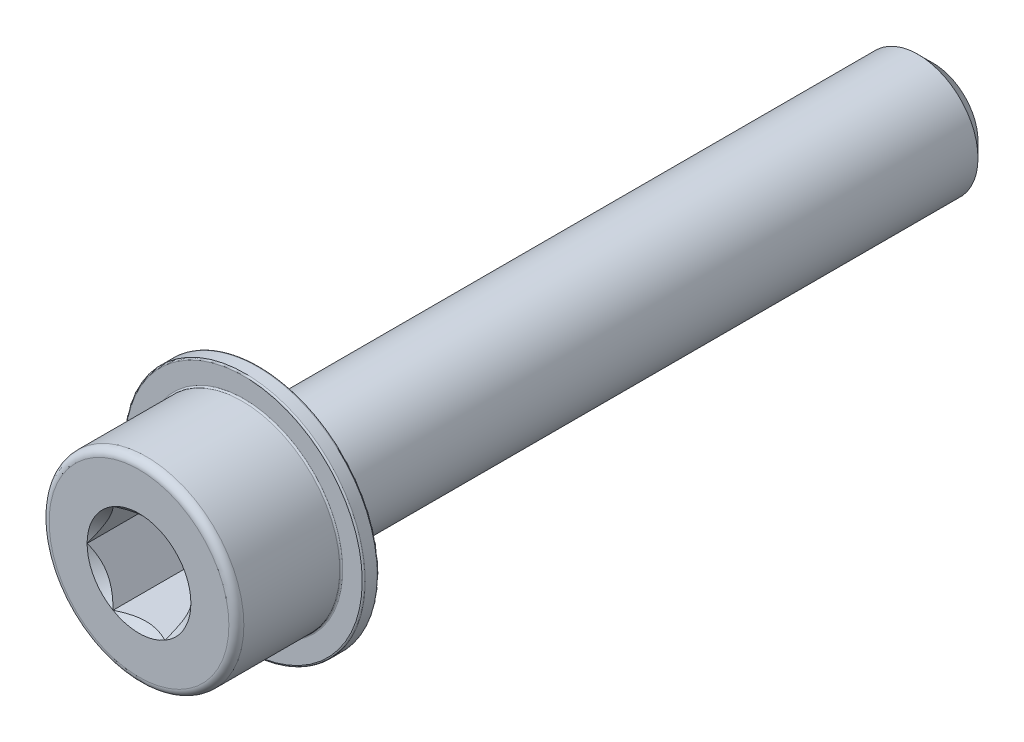
ISO-10303-21;
HEADER;
FILE_DESCRIPTION(('STEP AP214'),'2;1');
FILE_NAME('part.step','',(''),(''),'','','');
FILE_SCHEMA(('AUTOMOTIVE_DESIGN { 1 0 10303 214 1 1 1 1 }'));
ENDSEC;
DATA;
#1=APPLICATION_CONTEXT('core data for automotive mechanical design processes');
#2=APPLICATION_PROTOCOL_DEFINITION('international standard','automotive_design',2000,#1);
#3=PRODUCT_CONTEXT('',#1,'mechanical');
#4=PRODUCT('Part','Part','',(#3));
#5=PRODUCT_RELATED_PRODUCT_CATEGORY('part','',(#4));
#6=PRODUCT_DEFINITION_FORMATION('','',#4);
#7=PRODUCT_DEFINITION_CONTEXT('part definition',#1,'design');
#8=PRODUCT_DEFINITION('design','',#6,#7);
#9=PRODUCT_DEFINITION_SHAPE('','',#8);
#10=(LENGTH_UNIT() NAMED_UNIT(*) SI_UNIT(.MILLI.,.METRE.));
#11=(NAMED_UNIT(*) PLANE_ANGLE_UNIT() SI_UNIT($,.RADIAN.));
#12=(NAMED_UNIT(*) SI_UNIT($,.STERADIAN.) SOLID_ANGLE_UNIT());
#13=UNCERTAINTY_MEASURE_WITH_UNIT(LENGTH_MEASURE(1.E-05),#10,'distance_accuracy_value','');
#14=(GEOMETRIC_REPRESENTATION_CONTEXT(3) GLOBAL_UNCERTAINTY_ASSIGNED_CONTEXT((#13)) GLOBAL_UNIT_ASSIGNED_CONTEXT((#10,
#11,#12)) REPRESENTATION_CONTEXT('',''));
#15=CARTESIAN_POINT('',(0.,0.,0.));
#16=DIRECTION('',(0.,0.,1.));
#17=DIRECTION('',(1.,0.,0.));
#18=AXIS2_PLACEMENT_3D('',#15,#16,#17);
#19=CARTESIAN_POINT('',(0.,0.,53.));
#20=DIRECTION('',(0.,0.,-1.));
#21=DIRECTION('',(-1.,0.,0.));
#22=AXIS2_PLACEMENT_3D('',#19,#20,#21);
#23=CYLINDRICAL_SURFACE('',#22,6.5);
#24=CARTESIAN_POINT('',(0.,0.,46.1));
#25=DIRECTION('',(0.,0.,-1.));
#26=DIRECTION('',(-1.,0.,0.));
#27=AXIS2_PLACEMENT_3D('',#24,#25,#26);
#28=CIRCLE('',#27,6.5);
#29=CARTESIAN_POINT('',(-6.5,0.,46.1));
#30=VERTEX_POINT('',#29);
#31=EDGE_CURVE('E11',#30,#30,#28,.F.);
#32=ORIENTED_EDGE('',*,*,#31,.T.);
#33=EDGE_LOOP('',(#32));
#34=FACE_BOUND('',#33,.T.);
#35=CARTESIAN_POINT('',(0.,0.,52.5));
#36=DIRECTION('',(0.,0.,1.));
#37=DIRECTION('',(1.,0.,0.));
#38=AXIS2_PLACEMENT_3D('',#35,#36,#37);
#39=CIRCLE('',#38,6.5);
#40=CARTESIAN_POINT('',(6.5,0.,52.5));
#41=VERTEX_POINT('',#40);
#42=EDGE_CURVE('E275',#41,#41,#39,.F.);
#43=ORIENTED_EDGE('',*,*,#42,.T.);
#44=EDGE_LOOP('',(#43));
#45=FACE_BOUND('',#44,.T.);
#46=ADVANCED_FACE('F41',(#34,#45),#23,.T.);
#47=CARTESIAN_POINT('',(0.,0.,53.));
#48=DIRECTION('',(0.,0.,1.));
#49=DIRECTION('',(1.,0.,0.));
#50=AXIS2_PLACEMENT_3D('',#47,#48,#49);
#51=PLANE('',#50);
#52=CARTESIAN_POINT('',(0.,0.,53.));
#53=DIRECTION('',(0.,0.,1.));
#54=DIRECTION('',(1.,0.,0.));
#55=AXIS2_PLACEMENT_3D('',#52,#53,#54);
#56=CIRCLE('',#55,6.);
#57=CARTESIAN_POINT('',(6.,0.,53.));
#58=VERTEX_POINT('',#57);
#59=EDGE_CURVE('E117',#58,#58,#56,.T.);
#60=ORIENTED_EDGE('',*,*,#59,.T.);
#61=EDGE_LOOP('',(#60));
#62=FACE_BOUND('',#61,.T.);
#63=CARTESIAN_POINT('',(0.,0.,53.));
#64=DIRECTION('',(0.,0.,1.));
#65=DIRECTION('',(1.,0.,0.));
#66=AXIS2_PLACEMENT_3D('',#63,#64,#65);
#67=CIRCLE('',#66,3.46410161513776);
#68=CARTESIAN_POINT('',(3.46410161513776,0.,53.));
#69=VERTEX_POINT('',#68);
#70=CARTESIAN_POINT('',(1.73205080756888,3.,53.));
#71=VERTEX_POINT('',#70);
#72=EDGE_CURVE('E96',#69,#71,#67,.T.);
#73=ORIENTED_EDGE('',*,*,#72,.F.);
#74=CARTESIAN_POINT('',(1.73205080756888,-3.,53.));
#75=VERTEX_POINT('',#74);
#76=EDGE_CURVE('E56',#75,#69,#67,.T.);
#77=ORIENTED_EDGE('',*,*,#76,.F.);
#78=CARTESIAN_POINT('',(-1.73205080756888,-3.,53.));
#79=VERTEX_POINT('',#78);
#80=EDGE_CURVE('E360',#79,#75,#67,.T.);
#81=ORIENTED_EDGE('',*,*,#80,.F.);
#82=CARTESIAN_POINT('',(-3.46410161513776,0.,53.));
#83=VERTEX_POINT('',#82);
#84=EDGE_CURVE('E63',#83,#79,#67,.T.);
#85=ORIENTED_EDGE('',*,*,#84,.F.);
#86=CARTESIAN_POINT('',(-1.73205080756888,3.,53.));
#87=VERTEX_POINT('',#86);
#88=EDGE_CURVE('E141',#87,#83,#67,.T.);
#89=ORIENTED_EDGE('',*,*,#88,.F.);
#90=EDGE_CURVE('E106',#71,#87,#67,.T.);
#91=ORIENTED_EDGE('',*,*,#90,.F.);
#92=EDGE_LOOP('',(#73,#77,#81,#85,#89,#91));
#93=FACE_BOUND('',#92,.T.);
#94=ADVANCED_FACE('F140',(#62,#93),#51,.T.);
#95=CARTESIAN_POINT('',(0.,0.,53.));
#96=DIRECTION('',(0.,0.,1.));
#97=DIRECTION('',(1.,0.,0.));
#98=AXIS2_PLACEMENT_3D('',#95,#96,#97);
#99=CONICAL_SURFACE('',#98,3.46410161513776,0.785398163397449);
#100=ORIENTED_EDGE('',*,*,#90,.T.);
#101=CARTESIAN_POINT('',(-3.40188153141397,3.,54.071623018675));
#102=CARTESIAN_POINT('',(-3.31880839496224,3.,54.0093307707653));
#103=CARTESIAN_POINT('',(-3.23526432463499,3.,53.9476562262713));
#104=CARTESIAN_POINT('',(-3.06705083944725,3.,53.825817186681));
#105=CARTESIAN_POINT('',(-2.98238114192822,3.,53.7656530822642));
#106=CARTESIAN_POINT('',(-2.81111390830011,3.,53.6466823260063));
#107=CARTESIAN_POINT('',(-2.72450651479473,3.,53.5878898159252));
#108=CARTESIAN_POINT('',(-2.54981284655259,3.,53.4725516902232));
#109=CARTESIAN_POINT('',(-2.46172667795769,3.,53.4160059143113));
#110=CARTESIAN_POINT('',(-2.27892768432208,3.,53.3026064434241));
#111=CARTESIAN_POINT('',(-2.18411772294209,3.,53.2459085325007));
#112=CARTESIAN_POINT('',(-1.99231796342786,3.,53.1363338489189));
#113=CARTESIAN_POINT('',(-1.89532845598628,3.,53.0834565706102));
#114=CARTESIAN_POINT('',(-1.69915024178689,3.,52.9826433846406));
#115=CARTESIAN_POINT('',(-1.59996871640864,3.,52.9346936118117));
#116=CARTESIAN_POINT('',(-1.39893527870467,3.,52.8448170133997));
#117=CARTESIAN_POINT('',(-1.29708458210817,3.,52.8028875002659));
#118=CARTESIAN_POINT('',(-1.0982186531427,3.,52.7293601977538));
#119=CARTESIAN_POINT('',(-1.00140329048654,3.,52.6972274830937));
#120=CARTESIAN_POINT('',(-0.805487586800682,3.,52.6407367466802));
#121=CARTESIAN_POINT('',(-0.706387084473372,3.,52.6163792755582));
#122=CARTESIAN_POINT('',(-0.508116211624924,3.,52.5771014895869));
#123=CARTESIAN_POINT('',(-0.408977763183683,3.,52.5620226377466));
#124=CARTESIAN_POINT('',(-0.209698791301063,3.,52.5415865192691));
#125=CARTESIAN_POINT('',(-0.109558431989065,3.,52.5362276857281));
#126=CARTESIAN_POINT('',(0.0873520516843396,3.,52.535609235846));
#127=CARTESIAN_POINT('',(0.184121252918255,3.,52.5400131533177));
#128=CARTESIAN_POINT('',(0.376804854524576,3.,52.557946416793));
#129=CARTESIAN_POINT('',(0.472719169351943,3.,52.5714766658714));
#130=CARTESIAN_POINT('',(0.664619663322419,3.,52.6071635369876));
#131=CARTESIAN_POINT('',(0.760578448954833,3.,52.6294651712297));
#132=CARTESIAN_POINT('',(0.950411386335508,3.,52.6815211461887));
#133=CARTESIAN_POINT('',(1.04428572934496,3.,52.7112748000321));
#134=CARTESIAN_POINT('',(1.23968230612517,3.,52.7805237867733));
#135=CARTESIAN_POINT('',(1.34095401081408,3.,52.8207192131534));
#136=CARTESIAN_POINT('',(1.54084264319093,3.,52.9072590407946));
#137=CARTESIAN_POINT('',(1.63945865301323,3.,52.9536055360041));
#138=CARTESIAN_POINT('',(1.8345457021536,3.,53.0513511324151));
#139=CARTESIAN_POINT('',(1.93100848905254,3.,53.1027665721575));
#140=CARTESIAN_POINT('',(2.12170828880386,3.,53.2095076183011));
#141=CARTESIAN_POINT('',(2.21594570238895,3.,53.2648325134343));
#142=CARTESIAN_POINT('',(2.39783630702513,3.,53.3757799204079));
#143=CARTESIAN_POINT('',(2.48558325753569,3.,53.4312495308021));
#144=CARTESIAN_POINT('',(2.65957133871346,3.,53.5445092718899));
#145=CARTESIAN_POINT('',(2.74581235420106,3.,53.6022995789736));
#146=CARTESIAN_POINT('',(2.91628413803161,3.,53.7193054641893));
#147=CARTESIAN_POINT('',(3.00052556721126,3.,53.7785055655618));
#148=CARTESIAN_POINT('',(3.16785911169908,3.,53.8984622960702));
#149=CARTESIAN_POINT('',(3.25095153629611,3.,53.9592184932626));
#150=CARTESIAN_POINT('',(3.33356317170769,3.,54.0206105740407));
#151=B_SPLINE_CURVE_WITH_KNOTS('',3,(#101,#102,#103,#104,#105,#106,#107,#108,#109,#110,#111,
#112,#113,#114,#115,#116,#117,#118,#119,#120,#121,#122,#123,#124,#125,#126,#127,#128,#129,#130,
#131,#132,#133,#134,#135,#136,#137,#138,#139,#140,#141,#142,#143,#144,#145,#146,#147,#148,#149,
#150),.UNSPECIFIED.,.F.,.F.,(4,2,2,2,2,2,2,2,2,2,2,2,2,2,2,2,2,2,2,2,2,2,2,2,4),(0.,
0.311507889644127,0.623095538398646,0.937099065704866,1.25108015037407,1.58241857439007,
1.91371306604159,2.24404824101607,2.57423548692227,2.87999017792551,3.18576651722764,
3.486161620239,3.78650829411698,4.07666515932723,4.36685074054528,4.6620503227987,
4.95722270569223,5.283837715833,5.61056419890146,5.93838056110907,6.26613743475899,
6.57752286720455,6.88893201218749,7.19780024979462,7.50658366111557),.UNSPECIFIED.);
#152=EDGE_CURVE('E111',#71,#87,#151,.F.);
#153=ORIENTED_EDGE('',*,*,#152,.F.);
#154=EDGE_LOOP('',(#100,#153));
#155=FACE_BOUND('',#154,.T.);
#156=ADVANCED_FACE('F112',(#155),#99,.F.);
#157=ORIENTED_EDGE('',*,*,#88,.T.);
#158=CARTESIAN_POINT('',(-1.73193533751504,3.0002,53.0001154758272));
#159=CARTESIAN_POINT('',(-1.79147372663452,2.89707648504425,52.9406283183218));
#160=CARTESIAN_POINT('',(-1.85200767512883,2.79222861066935,52.8846349794655));
#161=CARTESIAN_POINT('',(-1.97544301635334,2.5784323282189,52.7821125963789));
#162=CARTESIAN_POINT('',(-2.03835614749388,2.46946358862024,52.7356405937413));
#163=CARTESIAN_POINT('',(-2.16521745390422,2.24973336040297,52.6560331885163));
#164=CARTESIAN_POINT('',(-2.22913332270057,2.13902782823778,52.6226977006427));
#165=CARTESIAN_POINT('',(-2.35837216363117,1.91517958943467,52.5713375439793));
#166=CARTESIAN_POINT('',(-2.42369118784644,1.802043720793,52.5532745375356));
#167=CARTESIAN_POINT('',(-2.53626564359199,1.60705904380729,52.5369769084505));
#168=CARTESIAN_POINT('',(-2.58337569224233,1.52546204599786,52.5345643671738));
#169=CARTESIAN_POINT('',(-2.67751916315866,1.36240077116991,52.5386294346571));
#170=CARTESIAN_POINT('',(-2.7245525527757,1.28093655070101,52.5451101600283));
#171=CARTESIAN_POINT('',(-2.81817374583238,1.11877988766163,52.5665917225152));
#172=CARTESIAN_POINT('',(-2.86476099147974,1.0380884112157,52.5816020899673));
#173=CARTESIAN_POINT('',(-2.95713536549225,0.878091302108662,52.619323646066));
#174=CARTESIAN_POINT('',(-3.00292255491614,0.798785563690701,52.6420342443228));
#175=CARTESIAN_POINT('',(-3.0842086834051,0.657993859197244,52.6887606848539));
#176=CARTESIAN_POINT('',(-3.11988753362891,0.596196277853972,52.7115483276808));
#177=CARTESIAN_POINT('',(-3.19060468282508,0.473710582479779,52.7607962860574));
#178=CARTESIAN_POINT('',(-3.2256429622163,0.413022502364396,52.7872567136662));
#179=CARTESIAN_POINT('',(-3.29496858432307,0.292947002609138,52.8432569943914));
#180=CARTESIAN_POINT('',(-3.3292578988429,0.233556167704084,52.8727871644784));
#181=CARTESIAN_POINT('',(-3.39720147685868,0.115874438532734,52.9345390915755));
#182=CARTESIAN_POINT('',(-3.43085611477446,0.0575828957522676,52.9667591966594));
#183=CARTESIAN_POINT('',(-3.46421708519159,-0.000199999999998803,53.0001154758271));
#184=B_SPLINE_CURVE_WITH_KNOTS('',3,(#158,#159,#160,#161,#162,#163,#164,#165,#166,#167,#168,
#169,#170,#171,#172,#173,#174,#175,#176,#177,#178,#179,#180,#181,#182,#183),.UNSPECIFIED.,.F.,
.F.,(4,2,2,2,2,2,2,2,2,2,2,2,4),(0.,0.399603557139307,0.801535286397852,1.19708369162344,
1.59163620080174,1.87398941755845,2.15644160919094,2.43921001247426,2.72195674032139,
2.94657516661927,3.17120044767275,3.3951375283781,3.61893808380739),.UNSPECIFIED.);
#185=EDGE_CURVE('E105',#87,#83,#184,.T.);
#186=ORIENTED_EDGE('',*,*,#185,.F.);
#187=EDGE_LOOP('',(#157,#186));
#188=FACE_BOUND('',#187,.T.);
#189=ADVANCED_FACE('F371',(#188),#99,.F.);
#190=ORIENTED_EDGE('',*,*,#84,.T.);
#191=CARTESIAN_POINT('',(-3.46421708519159,0.000199999999998564,53.0001154758271));
#192=CARTESIAN_POINT('',(-3.40467869607211,-0.102923514955748,52.9406283183218));
#193=CARTESIAN_POINT('',(-3.3441447475778,-0.20777138933065,52.8846349794655));
#194=CARTESIAN_POINT('',(-3.22070940635329,-0.421567671781096,52.7821125963789));
#195=CARTESIAN_POINT('',(-3.15779627521275,-0.530536411379761,52.7356405937413));
#196=CARTESIAN_POINT('',(-3.03093496880241,-0.750266639597031,52.6560331885163));
#197=CARTESIAN_POINT('',(-2.96701910000606,-0.860972171762214,52.6226977006427));
#198=CARTESIAN_POINT('',(-2.83778025907546,-1.08482041056533,52.5713375439793));
#199=CARTESIAN_POINT('',(-2.77246123486019,-1.19795627920699,52.5532745375356));
#200=CARTESIAN_POINT('',(-2.65988677911464,-1.3929409561927,52.5369769084505));
#201=CARTESIAN_POINT('',(-2.6127767304643,-1.47453795400214,52.5345643671738));
#202=CARTESIAN_POINT('',(-2.51863325954798,-1.63759922883009,52.5386294346571));
#203=CARTESIAN_POINT('',(-2.47159986993094,-1.71906344929899,52.5451101600283));
#204=CARTESIAN_POINT('',(-2.37797867687426,-1.88122011233837,52.5665917225152));
#205=CARTESIAN_POINT('',(-2.33139143122689,-1.9619115887843,52.5816020899673));
#206=CARTESIAN_POINT('',(-2.23901705721438,-2.12190869789134,52.619323646066));
#207=CARTESIAN_POINT('',(-2.19322986779049,-2.2012144363093,52.6420342443228));
#208=CARTESIAN_POINT('',(-2.11194373930153,-2.34200614080275,52.6887606848539));
#209=CARTESIAN_POINT('',(-2.07626488907772,-2.40380372214602,52.7115483276808));
#210=CARTESIAN_POINT('',(-2.00554773988155,-2.52628941752022,52.7607962860574));
#211=CARTESIAN_POINT('',(-1.97050946049033,-2.5869774976356,52.7872567136662));
#212=CARTESIAN_POINT('',(-1.90118383838355,-2.70705299739086,52.8432569943914));
#213=CARTESIAN_POINT('',(-1.86689452386372,-2.76644383229592,52.8727871644784));
#214=CARTESIAN_POINT('',(-1.79895094584794,-2.88412556146727,52.9345390915755));
#215=CARTESIAN_POINT('',(-1.76529630793216,-2.94241710424774,52.9667591966594));
#216=CARTESIAN_POINT('',(-1.73193533751504,-3.0002,53.0001154758272));
#217=B_SPLINE_CURVE_WITH_KNOTS('',3,(#191,#192,#193,#194,#195,#196,#197,#198,#199,#200,#201,
#202,#203,#204,#205,#206,#207,#208,#209,#210,#211,#212,#213,#214,#215,#216),.UNSPECIFIED.,.F.,
.F.,(4,2,2,2,2,2,2,2,2,2,2,2,4),(0.,0.399603557139304,0.801535286397844,1.19708369162343,
1.59163620080173,1.87398941755844,2.15644160919093,2.43921001247425,2.72195674032138,
2.94657516661926,3.17120044767274,3.3951375283781,3.61893808380739),.UNSPECIFIED.);
#218=EDGE_CURVE('E154',#83,#79,#217,.T.);
#219=ORIENTED_EDGE('',*,*,#218,.F.);
#220=EDGE_LOOP('',(#190,#219));
#221=FACE_BOUND('',#220,.T.);
#222=ADVANCED_FACE('F373',(#221),#99,.F.);
#223=ORIENTED_EDGE('',*,*,#80,.T.);
#224=CARTESIAN_POINT('',(-3.40188153141397,-3.,54.071623018675));
#225=CARTESIAN_POINT('',(-3.31880839496224,-3.,54.0093307707653));
#226=CARTESIAN_POINT('',(-3.23526432463498,-3.,53.9476562262713));
#227=CARTESIAN_POINT('',(-3.06705083944725,-3.,53.825817186681));
#228=CARTESIAN_POINT('',(-2.98238114192822,-3.,53.7656530822642));
#229=CARTESIAN_POINT('',(-2.81111390830011,-3.,53.6466823260063));
#230=CARTESIAN_POINT('',(-2.72450651479473,-3.,53.5878898159252));
#231=CARTESIAN_POINT('',(-2.54981284655259,-3.,53.4725516902232));
#232=CARTESIAN_POINT('',(-2.46172667795768,-3.,53.4160059143113));
#233=CARTESIAN_POINT('',(-2.27892768432207,-3.,53.3026064434241));
#234=CARTESIAN_POINT('',(-2.18411772294209,-3.,53.2459085325007));
#235=CARTESIAN_POINT('',(-1.99231796342786,-3.,53.1363338489189));
#236=CARTESIAN_POINT('',(-1.89532845598629,-3.,53.0834565706102));
#237=CARTESIAN_POINT('',(-1.69915024178689,-3.,52.9826433846406));
#238=CARTESIAN_POINT('',(-1.59996871640864,-3.,52.9346936118117));
#239=CARTESIAN_POINT('',(-1.39893527870467,-3.,52.8448170133997));
#240=CARTESIAN_POINT('',(-1.29708458210817,-3.,52.8028875002659));
#241=CARTESIAN_POINT('',(-1.0982186531427,-3.,52.7293601977538));
#242=CARTESIAN_POINT('',(-1.00140329048654,-3.,52.6972274830937));
#243=CARTESIAN_POINT('',(-0.80548758680068,-3.,52.6407367466802));
#244=CARTESIAN_POINT('',(-0.70638708447337,-3.,52.6163792755582));
#245=CARTESIAN_POINT('',(-0.508116211624922,-3.,52.5771014895869));
#246=CARTESIAN_POINT('',(-0.408977763183681,-3.,52.5620226377466));
#247=CARTESIAN_POINT('',(-0.20969879130106,-3.,52.5415865192691));
#248=CARTESIAN_POINT('',(-0.109558431989063,-3.,52.5362276857281));
#249=CARTESIAN_POINT('',(0.0873520516843408,-3.,52.535609235846));
#250=CARTESIAN_POINT('',(0.184121252918256,-3.,52.5400131533177));
#251=CARTESIAN_POINT('',(0.376804854524577,-3.,52.557946416793));
#252=CARTESIAN_POINT('',(0.472719169351944,-3.,52.5714766658714));
#253=CARTESIAN_POINT('',(0.664619663322421,-3.,52.6071635369876));
#254=CARTESIAN_POINT('',(0.760578448954834,-3.,52.6294651712297));
#255=CARTESIAN_POINT('',(0.95041138633551,-3.,52.6815211461887));
#256=CARTESIAN_POINT('',(1.04428572934496,-3.,52.7112748000321));
#257=CARTESIAN_POINT('',(1.23968230612517,-3.,52.7805237867733));
#258=CARTESIAN_POINT('',(1.34095401081408,-3.,52.8207192131534));
#259=CARTESIAN_POINT('',(1.54084264319093,-3.,52.9072590407946));
#260=CARTESIAN_POINT('',(1.63945865301324,-3.,52.9536055360041));
#261=CARTESIAN_POINT('',(1.8345457021536,-3.,53.0513511324151));
#262=CARTESIAN_POINT('',(1.93100848905254,-3.,53.1027665721575));
#263=CARTESIAN_POINT('',(2.12170828880386,-3.,53.2095076183011));
#264=CARTESIAN_POINT('',(2.21594570238895,-3.,53.2648325134343));
#265=CARTESIAN_POINT('',(2.39783630702514,-3.,53.3757799204079));
#266=CARTESIAN_POINT('',(2.48558325753569,-3.,53.4312495308021));
#267=CARTESIAN_POINT('',(2.65957133871347,-3.,53.5445092718899));
#268=CARTESIAN_POINT('',(2.74581235420107,-3.,53.6022995789736));
#269=CARTESIAN_POINT('',(2.91628413803161,-3.,53.7193054641893));
#270=CARTESIAN_POINT('',(3.00052556721127,-3.,53.7785055655618));
#271=CARTESIAN_POINT('',(3.16785911169908,-3.,53.8984622960702));
#272=CARTESIAN_POINT('',(3.25095153629612,-3.,53.9592184932626));
#273=CARTESIAN_POINT('',(3.3335631717077,-3.,54.0206105740407));
#274=B_SPLINE_CURVE_WITH_KNOTS('',3,(#224,#225,#226,#227,#228,#229,#230,#231,#232,#233,#234,
#235,#236,#237,#238,#239,#240,#241,#242,#243,#244,#245,#246,#247,#248,#249,#250,#251,#252,#253,
#254,#255,#256,#257,#258,#259,#260,#261,#262,#263,#264,#265,#266,#267,#268,#269,#270,#271,#272,
#273),.UNSPECIFIED.,.F.,.F.,(4,2,2,2,2,2,2,2,2,2,2,2,2,2,2,2,2,2,2,2,2,2,2,2,4),(0.,
0.311507889644125,0.623095538398644,0.937099065704865,1.25108015037407,1.58241857439006,
1.91371306604159,2.24404824101607,2.57423548692227,2.87999017792551,3.18576651722764,
3.486161620239,3.78650829411698,4.07666515932722,4.36685074054528,4.6620503227987,
4.95722270569223,5.28383771583299,5.61056419890146,5.93838056110907,6.266137434759,
6.57752286720456,6.8889320121875,7.19780024979462,7.50658366111557),.UNSPECIFIED.);
#275=EDGE_CURVE('E184',#79,#75,#274,.T.);
#276=ORIENTED_EDGE('',*,*,#275,.F.);
#277=EDGE_LOOP('',(#223,#276));
#278=FACE_BOUND('',#277,.T.);
#279=ADVANCED_FACE('F361',(#278),#99,.F.);
#280=ORIENTED_EDGE('',*,*,#76,.T.);
#281=CARTESIAN_POINT('',(1.73193533751504,-3.0002,53.0001154758272));
#282=CARTESIAN_POINT('',(1.79147372663452,-2.89707648504425,52.9406283183218));
#283=CARTESIAN_POINT('',(1.85200767512883,-2.79222861066935,52.8846349794655));
#284=CARTESIAN_POINT('',(1.97544301635334,-2.57843232821891,52.7821125963789));
#285=CARTESIAN_POINT('',(2.03835614749388,-2.46946358862024,52.7356405937413));
#286=CARTESIAN_POINT('',(2.16521745390422,-2.24973336040297,52.6560331885163));
#287=CARTESIAN_POINT('',(2.22913332270057,-2.13902782823779,52.6226977006427));
#288=CARTESIAN_POINT('',(2.35837216363117,-1.91517958943468,52.5713375439793));
#289=CARTESIAN_POINT('',(2.42369118784644,-1.80204372079301,52.5532745375356));
#290=CARTESIAN_POINT('',(2.53626564359199,-1.6070590438073,52.5369769084505));
#291=CARTESIAN_POINT('',(2.58337569224233,-1.52546204599787,52.5345643671738));
#292=CARTESIAN_POINT('',(2.67751916315865,-1.36240077116991,52.5386294346571));
#293=CARTESIAN_POINT('',(2.7245525527757,-1.28093655070101,52.5451101600283));
#294=CARTESIAN_POINT('',(2.81817374583237,-1.11877988766163,52.5665917225152));
#295=CARTESIAN_POINT('',(2.86476099147974,-1.0380884112157,52.5816020899673));
#296=CARTESIAN_POINT('',(2.95713536549225,-0.878091302108666,52.619323646066));
#297=CARTESIAN_POINT('',(3.00292255491614,-0.798785563690705,52.6420342443228));
#298=CARTESIAN_POINT('',(3.0842086834051,-0.657993859197248,52.6887606848539));
#299=CARTESIAN_POINT('',(3.11988753362891,-0.596196277853976,52.7115483276808));
#300=CARTESIAN_POINT('',(3.19060468282508,-0.473710582479782,52.7607962860574));
#301=CARTESIAN_POINT('',(3.2256429622163,-0.413022502364398,52.7872567136662));
#302=CARTESIAN_POINT('',(3.29496858432308,-0.292947002609137,52.8432569943914));
#303=CARTESIAN_POINT('',(3.32925789884291,-0.233556167704082,52.8727871644784));
#304=CARTESIAN_POINT('',(3.39720147685869,-0.115874438532731,52.9345390915755));
#305=CARTESIAN_POINT('',(3.43085611477447,-0.0575828957522658,52.9667591966594));
#306=CARTESIAN_POINT('',(3.46421708519159,0.000200000000000719,53.0001154758272));
#307=B_SPLINE_CURVE_WITH_KNOTS('',3,(#281,#282,#283,#284,#285,#286,#287,#288,#289,#290,#291,
#292,#293,#294,#295,#296,#297,#298,#299,#300,#301,#302,#303,#304,#305,#306),.UNSPECIFIED.,.F.,
.F.,(4,2,2,2,2,2,2,2,2,2,2,2,4),(0.,0.399603557139305,0.801535286397845,1.19708369162343,
1.59163620080173,1.87398941755844,2.15644160919093,2.43921001247425,2.72195674032138,
2.94657516661927,3.17120044767274,3.3951375283781,3.61893808380739),.UNSPECIFIED.);
#308=EDGE_CURVE('E129',#75,#69,#307,.T.);
#309=ORIENTED_EDGE('',*,*,#308,.F.);
#310=EDGE_LOOP('',(#280,#309));
#311=FACE_BOUND('',#310,.T.);
#312=ADVANCED_FACE('F169',(#311),#99,.F.);
#313=ORIENTED_EDGE('',*,*,#72,.T.);
#314=CARTESIAN_POINT('',(3.46421708519159,-0.000199999999999999,53.0001154758272));
#315=CARTESIAN_POINT('',(3.40467869607211,0.102923514955748,52.9406283183218));
#316=CARTESIAN_POINT('',(3.3441447475778,0.20777138933065,52.8846349794655));
#317=CARTESIAN_POINT('',(3.2207094063533,0.421567671781094,52.7821125963789));
#318=CARTESIAN_POINT('',(3.15779627521275,0.530536411379758,52.7356405937413));
#319=CARTESIAN_POINT('',(3.03093496880242,0.750266639597028,52.6560331885163));
#320=CARTESIAN_POINT('',(2.96701910000607,0.860972171762212,52.6226977006427));
#321=CARTESIAN_POINT('',(2.83778025907547,1.08482041056533,52.5713375439793));
#322=CARTESIAN_POINT('',(2.7724612348602,1.19795627920699,52.5532745375356));
#323=CARTESIAN_POINT('',(2.65988677911464,1.3929409561927,52.5369769084505));
#324=CARTESIAN_POINT('',(2.6127767304643,1.47453795400214,52.5345643671738));
#325=CARTESIAN_POINT('',(2.51863325954798,1.63759922883009,52.5386294346571));
#326=CARTESIAN_POINT('',(2.47159986993094,1.71906344929899,52.5451101600283));
#327=CARTESIAN_POINT('',(2.37797867687426,1.88122011233837,52.5665917225152));
#328=CARTESIAN_POINT('',(2.33139143122689,1.9619115887843,52.5816020899673));
#329=CARTESIAN_POINT('',(2.23901705721438,2.12190869789134,52.619323646066));
#330=CARTESIAN_POINT('',(2.19322986779049,2.2012144363093,52.6420342443228));
#331=CARTESIAN_POINT('',(2.11194373930153,2.34200614080275,52.6887606848539));
#332=CARTESIAN_POINT('',(2.07626488907772,2.40380372214603,52.7115483276808));
#333=CARTESIAN_POINT('',(2.00554773988155,2.52628941752022,52.7607962860574));
#334=CARTESIAN_POINT('',(1.97050946049034,2.5869774976356,52.7872567136662));
#335=CARTESIAN_POINT('',(1.90118383838356,2.70705299739086,52.8432569943914));
#336=CARTESIAN_POINT('',(1.86689452386373,2.76644383229592,52.8727871644784));
#337=CARTESIAN_POINT('',(1.79895094584795,2.88412556146727,52.9345390915755));
#338=CARTESIAN_POINT('',(1.76529630793217,2.94241710424774,52.9667591966594));
#339=CARTESIAN_POINT('',(1.73193533751504,3.0002,53.0001154758272));
#340=B_SPLINE_CURVE_WITH_KNOTS('',3,(#314,#315,#316,#317,#318,#319,#320,#321,#322,#323,#324,
#325,#326,#327,#328,#329,#330,#331,#332,#333,#334,#335,#336,#337,#338,#339),.UNSPECIFIED.,.F.,
.F.,(4,2,2,2,2,2,2,2,2,2,2,2,4),(0.,0.399603557139305,0.801535286397845,1.19708369162343,
1.59163620080173,1.87398941755844,2.15644160919093,2.43921001247425,2.72195674032138,
2.94657516661927,3.17120044767274,3.3951375283781,3.61893808380739),.UNSPECIFIED.);
#341=EDGE_CURVE('E100',#69,#71,#340,.T.);
#342=ORIENTED_EDGE('',*,*,#341,.F.);
#343=EDGE_LOOP('',(#313,#342));
#344=FACE_BOUND('',#343,.T.);
#345=ADVANCED_FACE('F98',(#344),#99,.F.);
#346=CARTESIAN_POINT('',(0.,0.,47.));
#347=DIRECTION('',(0.,0.,1.));
#348=DIRECTION('',(1.,0.,0.));
#349=AXIS2_PLACEMENT_3D('',#346,#347,#348);
#350=PLANE('',#349);
#351=DIRECTION('',(-0.5,0.866025403784439,0.));
#352=VECTOR('',#351,1.);
#353=CARTESIAN_POINT('',(3.46410161513776,0.,47.));
#354=LINE('',#353,#352);
#355=CARTESIAN_POINT('',(3.46410161513776,0.,47.));
#356=VERTEX_POINT('',#355);
#357=CARTESIAN_POINT('',(1.73205080756888,3.,47.));
#358=VERTEX_POINT('',#357);
#359=EDGE_CURVE('E128',#356,#358,#354,.T.);
#360=ORIENTED_EDGE('',*,*,#359,.T.);
#361=DIRECTION('',(-1.,0.,0.));
#362=VECTOR('',#361,1.);
#363=CARTESIAN_POINT('',(1.73205080756888,3.,47.));
#364=LINE('',#363,#362);
#365=CARTESIAN_POINT('',(-1.73205080756888,3.,47.));
#366=VERTEX_POINT('',#365);
#367=EDGE_CURVE('E133',#358,#366,#364,.T.);
#368=ORIENTED_EDGE('',*,*,#367,.T.);
#369=DIRECTION('',(-0.5,-0.866025403784439,0.));
#370=VECTOR('',#369,1.);
#371=CARTESIAN_POINT('',(-1.73205080756888,3.,47.));
#372=LINE('',#371,#370);
#373=CARTESIAN_POINT('',(-3.46410161513775,0.,47.));
#374=VERTEX_POINT('',#373);
#375=EDGE_CURVE('E347',#366,#374,#372,.T.);
#376=ORIENTED_EDGE('',*,*,#375,.T.);
#377=DIRECTION('',(0.5,-0.866025403784439,0.));
#378=VECTOR('',#377,1.);
#379=CARTESIAN_POINT('',(-3.46410161513775,0.,47.));
#380=LINE('',#379,#378);
#381=CARTESIAN_POINT('',(-1.73205080756887,-3.,47.));
#382=VERTEX_POINT('',#381);
#383=EDGE_CURVE('E343',#374,#382,#380,.T.);
#384=ORIENTED_EDGE('',*,*,#383,.T.);
#385=DIRECTION('',(1.,0.,0.));
#386=VECTOR('',#385,1.);
#387=CARTESIAN_POINT('',(-1.73205080756887,-3.,47.));
#388=LINE('',#387,#386);
#389=CARTESIAN_POINT('',(1.73205080756888,-3.,47.));
#390=VERTEX_POINT('',#389);
#391=EDGE_CURVE('E339',#382,#390,#388,.T.);
#392=ORIENTED_EDGE('',*,*,#391,.T.);
#393=DIRECTION('',(0.5,0.866025403784439,0.));
#394=VECTOR('',#393,1.);
#395=CARTESIAN_POINT('',(1.73205080756888,-3.,47.));
#396=LINE('',#395,#394);
#397=EDGE_CURVE('E137',#390,#356,#396,.T.);
#398=ORIENTED_EDGE('',*,*,#397,.T.);
#399=EDGE_LOOP('',(#360,#368,#376,#384,#392,#398));
#400=FACE_BOUND('',#399,.T.);
#401=ADVANCED_FACE('F168',(#400),#350,.T.);
#402=CARTESIAN_POINT('',(1.73205080756888,3.,47.));
#403=DIRECTION('',(0.,1.,0.));
#404=DIRECTION('',(-1.,0.,0.));
#405=AXIS2_PLACEMENT_3D('',#402,#403,#404);
#406=PLANE('',#405);
#407=DIRECTION('',(0.,0.,1.));
#408=VECTOR('',#407,1.);
#409=CARTESIAN_POINT('',(1.73205080756888,3.,47.));
#410=LINE('',#409,#408);
#411=EDGE_CURVE('E124',#358,#71,#410,.T.);
#412=ORIENTED_EDGE('',*,*,#411,.T.);
#413=ORIENTED_EDGE('',*,*,#152,.T.);
#414=DIRECTION('',(0.,0.,1.));
#415=VECTOR('',#414,1.);
#416=CARTESIAN_POINT('',(-1.73205080756888,3.,47.));
#417=LINE('',#416,#415);
#418=EDGE_CURVE('E136',#366,#87,#417,.T.);
#419=ORIENTED_EDGE('',*,*,#418,.F.);
#420=ORIENTED_EDGE('',*,*,#367,.F.);
#421=EDGE_LOOP('',(#412,#413,#419,#420));
#422=FACE_BOUND('',#421,.T.);
#423=ADVANCED_FACE('F131',(#422),#406,.F.);
#424=CARTESIAN_POINT('',(-1.73205080756888,3.,47.));
#425=DIRECTION('',(-0.866025403784439,0.5,0.));
#426=DIRECTION('',(-0.5,-0.866025403784439,0.));
#427=AXIS2_PLACEMENT_3D('',#424,#425,#426);
#428=PLANE('',#427);
#429=ORIENTED_EDGE('',*,*,#418,.T.);
#430=ORIENTED_EDGE('',*,*,#185,.T.);
#431=DIRECTION('',(0.,0.,1.));
#432=VECTOR('',#431,1.);
#433=CARTESIAN_POINT('',(-3.46410161513775,0.,47.));
#434=LINE('',#433,#432);
#435=EDGE_CURVE('E327',#374,#83,#434,.T.);
#436=ORIENTED_EDGE('',*,*,#435,.F.);
#437=ORIENTED_EDGE('',*,*,#375,.F.);
#438=EDGE_LOOP('',(#429,#430,#436,#437));
#439=FACE_BOUND('',#438,.T.);
#440=ADVANCED_FACE('F161',(#439),#428,.F.);
#441=CARTESIAN_POINT('',(-3.46410161513775,0.,47.));
#442=DIRECTION('',(-0.866025403784439,-0.5,0.));
#443=DIRECTION('',(0.5,-0.866025403784439,0.));
#444=AXIS2_PLACEMENT_3D('',#441,#442,#443);
#445=PLANE('',#444);
#446=ORIENTED_EDGE('',*,*,#435,.T.);
#447=ORIENTED_EDGE('',*,*,#218,.T.);
#448=DIRECTION('',(0.,0.,1.));
#449=VECTOR('',#448,1.);
#450=CARTESIAN_POINT('',(-1.73205080756887,-3.,47.));
#451=LINE('',#450,#449);
#452=EDGE_CURVE('E330',#382,#79,#451,.T.);
#453=ORIENTED_EDGE('',*,*,#452,.F.);
#454=ORIENTED_EDGE('',*,*,#383,.F.);
#455=EDGE_LOOP('',(#446,#447,#453,#454));
#456=FACE_BOUND('',#455,.T.);
#457=ADVANCED_FACE('F209',(#456),#445,.F.);
#458=CARTESIAN_POINT('',(-1.73205080756887,-3.,47.));
#459=DIRECTION('',(0.,-1.,0.));
#460=DIRECTION('',(1.,0.,0.));
#461=AXIS2_PLACEMENT_3D('',#458,#459,#460);
#462=PLANE('',#461);
#463=ORIENTED_EDGE('',*,*,#452,.T.);
#464=ORIENTED_EDGE('',*,*,#275,.T.);
#465=DIRECTION('',(0.,0.,1.));
#466=VECTOR('',#465,1.);
#467=CARTESIAN_POINT('',(1.73205080756888,-3.,47.));
#468=LINE('',#467,#466);
#469=EDGE_CURVE('E310',#390,#75,#468,.T.);
#470=ORIENTED_EDGE('',*,*,#469,.F.);
#471=ORIENTED_EDGE('',*,*,#391,.F.);
#472=EDGE_LOOP('',(#463,#464,#470,#471));
#473=FACE_BOUND('',#472,.T.);
#474=ADVANCED_FACE('F205',(#473),#462,.F.);
#475=CARTESIAN_POINT('',(1.73205080756888,-3.,47.));
#476=DIRECTION('',(0.866025403784439,-0.5,0.));
#477=DIRECTION('',(0.5,0.866025403784439,0.));
#478=AXIS2_PLACEMENT_3D('',#475,#476,#477);
#479=PLANE('',#478);
#480=ORIENTED_EDGE('',*,*,#469,.T.);
#481=ORIENTED_EDGE('',*,*,#308,.T.);
#482=DIRECTION('',(0.,0.,1.));
#483=VECTOR('',#482,1.);
#484=CARTESIAN_POINT('',(3.46410161513776,0.,47.));
#485=LINE('',#484,#483);
#486=EDGE_CURVE('E126',#356,#69,#485,.T.);
#487=ORIENTED_EDGE('',*,*,#486,.F.);
#488=ORIENTED_EDGE('',*,*,#397,.F.);
#489=EDGE_LOOP('',(#480,#481,#487,#488));
#490=FACE_BOUND('',#489,.T.);
#491=ADVANCED_FACE('F202',(#490),#479,.F.);
#492=CARTESIAN_POINT('',(3.46410161513776,0.,47.));
#493=DIRECTION('',(0.866025403784438,0.5,0.));
#494=DIRECTION('',(-0.5,0.866025403784439,0.));
#495=AXIS2_PLACEMENT_3D('',#492,#493,#494);
#496=PLANE('',#495);
#497=ORIENTED_EDGE('',*,*,#486,.T.);
#498=ORIENTED_EDGE('',*,*,#341,.T.);
#499=ORIENTED_EDGE('',*,*,#411,.F.);
#500=ORIENTED_EDGE('',*,*,#359,.F.);
#501=EDGE_LOOP('',(#497,#498,#499,#500));
#502=FACE_BOUND('',#501,.T.);
#503=ADVANCED_FACE('F122',(#502),#496,.F.);
#504=CARTESIAN_POINT('',(0.,0.,52.5));
#505=DIRECTION('',(0.,0.,1.));
#506=DIRECTION('',(1.,0.,0.));
#507=AXIS2_PLACEMENT_3D('',#504,#505,#506);
#508=TOROIDAL_SURFACE('',#507,6.,0.5);
#509=ORIENTED_EDGE('',*,*,#42,.F.);
#510=EDGE_LOOP('',(#509));
#511=FACE_BOUND('',#510,.T.);
#512=ORIENTED_EDGE('',*,*,#59,.F.);
#513=EDGE_LOOP('',(#512));
#514=FACE_BOUND('',#513,.T.);
#515=ADVANCED_FACE('F244',(#511,#514),#508,.T.);
#516=CARTESIAN_POINT('',(0.,0.,46.));
#517=DIRECTION('',(0.,0.,-1.));
#518=DIRECTION('',(-1.,0.,0.));
#519=AXIS2_PLACEMENT_3D('',#516,#517,#518);
#520=CYLINDRICAL_SURFACE('',#519,8.);
#521=CARTESIAN_POINT('',(0.,0.,45.1));
#522=DIRECTION('',(0.,0.,1.));
#523=DIRECTION('',(1.,0.,0.));
#524=AXIS2_PLACEMENT_3D('',#521,#522,#523);
#525=CIRCLE('',#524,8.);
#526=CARTESIAN_POINT('',(8.,0.,45.1));
#527=VERTEX_POINT('',#526);
#528=EDGE_CURVE('E266',#527,#527,#525,.T.);
#529=ORIENTED_EDGE('',*,*,#528,.T.);
#530=EDGE_LOOP('',(#529));
#531=FACE_BOUND('',#530,.T.);
#532=CARTESIAN_POINT('',(0.,0.,45.9));
#533=DIRECTION('',(0.,0.,-1.));
#534=DIRECTION('',(-1.,0.,0.));
#535=AXIS2_PLACEMENT_3D('',#532,#533,#534);
#536=CIRCLE('',#535,8.);
#537=CARTESIAN_POINT('',(-8.,0.,45.9));
#538=VERTEX_POINT('',#537);
#539=EDGE_CURVE('E263',#538,#538,#536,.T.);
#540=ORIENTED_EDGE('',*,*,#539,.T.);
#541=EDGE_LOOP('',(#540));
#542=FACE_BOUND('',#541,.T.);
#543=ADVANCED_FACE('F170',(#531,#542),#520,.T.);
#544=CARTESIAN_POINT('',(0.,0.,46.));
#545=DIRECTION('',(0.,0.,-1.));
#546=DIRECTION('',(-1.,0.,0.));
#547=AXIS2_PLACEMENT_3D('',#544,#545,#546);
#548=PLANE('',#547);
#549=CARTESIAN_POINT('',(0.,0.,46.));
#550=DIRECTION('',(0.,0.,-1.));
#551=DIRECTION('',(-1.,0.,0.));
#552=AXIS2_PLACEMENT_3D('',#549,#550,#551);
#553=CIRCLE('',#552,7.9);
#554=CARTESIAN_POINT('',(-7.9,0.,46.));
#555=VERTEX_POINT('',#554);
#556=EDGE_CURVE('E50',#555,#555,#553,.F.);
#557=ORIENTED_EDGE('',*,*,#556,.T.);
#558=EDGE_LOOP('',(#557));
#559=FACE_BOUND('',#558,.T.);
#560=CARTESIAN_POINT('',(0.,0.,46.));
#561=DIRECTION('',(0.,0.,-1.));
#562=DIRECTION('',(-1.,0.,0.));
#563=AXIS2_PLACEMENT_3D('',#560,#561,#562);
#564=CIRCLE('',#563,6.6);
#565=CARTESIAN_POINT('',(-6.6,0.,46.));
#566=VERTEX_POINT('',#565);
#567=EDGE_CURVE('E272',#566,#566,#564,.T.);
#568=ORIENTED_EDGE('',*,*,#567,.T.);
#569=EDGE_LOOP('',(#568));
#570=FACE_BOUND('',#569,.T.);
#571=ADVANCED_FACE('F235',(#559,#570),#548,.F.);
#572=CARTESIAN_POINT('',(0.,0.,0.));
#573=DIRECTION('',(0.,0.,1.));
#574=DIRECTION('',(1.,0.,0.));
#575=AXIS2_PLACEMENT_3D('',#572,#573,#574);
#576=PLANE('',#575);
#577=CARTESIAN_POINT('',(0.,0.,0.));
#578=DIRECTION('',(0.,0.,1.));
#579=DIRECTION('',(1.,0.,0.));
#580=AXIS2_PLACEMENT_3D('',#577,#578,#579);
#581=CIRCLE('',#580,2.99999999999996);
#582=CARTESIAN_POINT('',(2.99999999999996,0.,0.));
#583=VERTEX_POINT('',#582);
#584=EDGE_CURVE('E118',#583,#583,#581,.F.);
#585=ORIENTED_EDGE('',*,*,#584,.T.);
#586=EDGE_LOOP('',(#585));
#587=FACE_BOUND('',#586,.T.);
#588=ADVANCED_FACE('F231',(#587),#576,.F.);
#589=CARTESIAN_POINT('',(0.,0.,1.00000000000003));
#590=DIRECTION('',(0.,0.,1.));
#591=DIRECTION('',(1.,0.,0.));
#592=AXIS2_PLACEMENT_3D('',#589,#590,#591);
#593=CONICAL_SURFACE('',#592,4.,0.785398163397452);
#594=ORIENTED_EDGE('',*,*,#584,.F.);
#595=EDGE_LOOP('',(#594));
#596=FACE_BOUND('',#595,.T.);
#597=CARTESIAN_POINT('',(0.,0.,1.00000000000003));
#598=DIRECTION('',(0.,0.,1.));
#599=DIRECTION('',(1.,0.,0.));
#600=AXIS2_PLACEMENT_3D('',#597,#598,#599);
#601=CIRCLE('',#600,4.);
#602=CARTESIAN_POINT('',(4.,0.,1.00000000000003));
#603=VERTEX_POINT('',#602);
#604=EDGE_CURVE('E304',#603,#603,#601,.T.);
#605=ORIENTED_EDGE('',*,*,#604,.F.);
#606=EDGE_LOOP('',(#605));
#607=FACE_BOUND('',#606,.T.);
#608=ADVANCED_FACE('F234',(#596,#607),#593,.T.);
#609=CARTESIAN_POINT('',(0.,0.,45.));
#610=DIRECTION('',(0.,0.,-1.));
#611=DIRECTION('',(-1.,0.,0.));
#612=AXIS2_PLACEMENT_3D('',#609,#610,#611);
#613=CYLINDRICAL_SURFACE('',#612,4.);
#614=ORIENTED_EDGE('',*,*,#604,.T.);
#615=EDGE_LOOP('',(#614));
#616=FACE_BOUND('',#615,.T.);
#617=CARTESIAN_POINT('',(0.,0.,45.));
#618=DIRECTION('',(0.,0.,1.));
#619=DIRECTION('',(1.,0.,0.));
#620=AXIS2_PLACEMENT_3D('',#617,#618,#619);
#621=CIRCLE('',#620,4.);
#622=CARTESIAN_POINT('',(4.,0.,45.));
#623=VERTEX_POINT('',#622);
#624=EDGE_CURVE('E301',#623,#623,#621,.T.);
#625=ORIENTED_EDGE('',*,*,#624,.F.);
#626=EDGE_LOOP('',(#625));
#627=FACE_BOUND('',#626,.T.);
#628=ADVANCED_FACE('F237',(#616,#627),#613,.T.);
#629=CARTESIAN_POINT('',(0.,0.,45.));
#630=DIRECTION('',(0.,0.,1.));
#631=DIRECTION('',(1.,0.,0.));
#632=AXIS2_PLACEMENT_3D('',#629,#630,#631);
#633=PLANE('',#632);
#634=CARTESIAN_POINT('',(0.,0.,45.));
#635=DIRECTION('',(0.,0.,1.));
#636=DIRECTION('',(1.,0.,0.));
#637=AXIS2_PLACEMENT_3D('',#634,#635,#636);
#638=CIRCLE('',#637,7.9);
#639=CARTESIAN_POINT('',(7.9,0.,45.));
#640=VERTEX_POINT('',#639);
#641=EDGE_CURVE('E267',#640,#640,#638,.F.);
#642=ORIENTED_EDGE('',*,*,#641,.T.);
#643=EDGE_LOOP('',(#642));
#644=FACE_BOUND('',#643,.T.);
#645=ORIENTED_EDGE('',*,*,#624,.T.);
#646=EDGE_LOOP('',(#645));
#647=FACE_BOUND('',#646,.T.);
#648=ADVANCED_FACE('F230',(#644,#647),#633,.F.);
#649=CARTESIAN_POINT('',(0.,0.,45.1));
#650=DIRECTION('',(0.,0.,1.));
#651=DIRECTION('',(1.,0.,0.));
#652=AXIS2_PLACEMENT_3D('',#649,#650,#651);
#653=TOROIDAL_SURFACE('',#652,7.9,0.1);
#654=ORIENTED_EDGE('',*,*,#528,.F.);
#655=EDGE_LOOP('',(#654));
#656=FACE_BOUND('',#655,.T.);
#657=ORIENTED_EDGE('',*,*,#641,.F.);
#658=EDGE_LOOP('',(#657));
#659=FACE_BOUND('',#658,.T.);
#660=ADVANCED_FACE('F248',(#656,#659),#653,.T.);
#661=CARTESIAN_POINT('',(0.,0.,45.9));
#662=DIRECTION('',(0.,0.,-1.));
#663=DIRECTION('',(-1.,0.,0.));
#664=AXIS2_PLACEMENT_3D('',#661,#662,#663);
#665=TOROIDAL_SURFACE('',#664,7.9,0.1);
#666=ORIENTED_EDGE('',*,*,#556,.F.);
#667=EDGE_LOOP('',(#666));
#668=FACE_BOUND('',#667,.T.);
#669=ORIENTED_EDGE('',*,*,#539,.F.);
#670=EDGE_LOOP('',(#669));
#671=FACE_BOUND('',#670,.T.);
#672=ADVANCED_FACE('F250',(#668,#671),#665,.T.);
#673=CARTESIAN_POINT('',(0.,0.,46.1));
#674=DIRECTION('',(0.,0.,-1.));
#675=DIRECTION('',(-1.,0.,0.));
#676=AXIS2_PLACEMENT_3D('',#673,#674,#675);
#677=TOROIDAL_SURFACE('',#676,6.6,0.1);
#678=ORIENTED_EDGE('',*,*,#31,.F.);
#679=EDGE_LOOP('',(#678));
#680=FACE_BOUND('',#679,.T.);
#681=ORIENTED_EDGE('',*,*,#567,.F.);
#682=EDGE_LOOP('',(#681));
#683=FACE_BOUND('',#682,.T.);
#684=ADVANCED_FACE('F43',(#680,#683),#677,.F.);
#685=CLOSED_SHELL('',(#46,#94,#156,#189,#222,#279,#312,#345,#401,#423,#440,#457,#474,#491,#503,
#515,#543,#571,#588,#608,#628,#648,#660,#672,#684));
#686=MANIFOLD_SOLID_BREP('B2',#685);
#687=ADVANCED_BREP_SHAPE_REPRESENTATION('',(#18,#686),#14);
#688=SHAPE_DEFINITION_REPRESENTATION(#9,#687);
ENDSEC;
END-ISO-10303-21;
